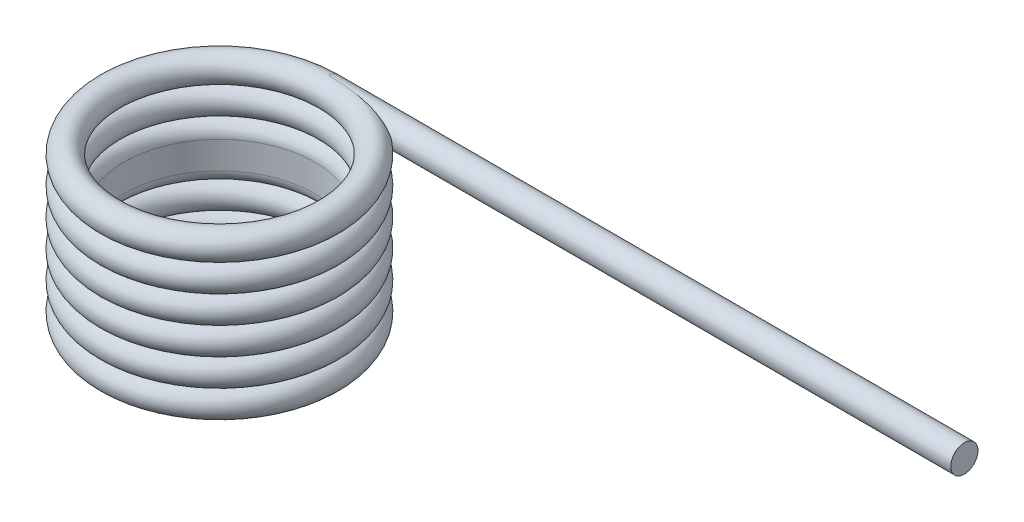
ISO-10303-21;
HEADER;
FILE_DESCRIPTION(('STEP AP214'),'2;1');
FILE_NAME('part.step','',(''),(''),'','','');
FILE_SCHEMA(('AUTOMOTIVE_DESIGN { 1 0 10303 214 1 1 1 1 }'));
ENDSEC;
DATA;
#1=APPLICATION_CONTEXT('core data for automotive mechanical design processes');
#2=APPLICATION_PROTOCOL_DEFINITION('international standard','automotive_design',2000,#1);
#3=PRODUCT_CONTEXT('',#1,'mechanical');
#4=PRODUCT('Part','Part','',(#3));
#5=PRODUCT_RELATED_PRODUCT_CATEGORY('part','',(#4));
#6=PRODUCT_DEFINITION_FORMATION('','',#4);
#7=PRODUCT_DEFINITION_CONTEXT('part definition',#1,'design');
#8=PRODUCT_DEFINITION('design','',#6,#7);
#9=PRODUCT_DEFINITION_SHAPE('','',#8);
#10=(LENGTH_UNIT() NAMED_UNIT(*) SI_UNIT(.MILLI.,.METRE.));
#11=(NAMED_UNIT(*) PLANE_ANGLE_UNIT() SI_UNIT($,.RADIAN.));
#12=(NAMED_UNIT(*) SI_UNIT($,.STERADIAN.) SOLID_ANGLE_UNIT());
#13=UNCERTAINTY_MEASURE_WITH_UNIT(LENGTH_MEASURE(1.E-05),#10,'distance_accuracy_value','');
#14=(GEOMETRIC_REPRESENTATION_CONTEXT(3) GLOBAL_UNCERTAINTY_ASSIGNED_CONTEXT((#13)) GLOBAL_UNIT_ASSIGNED_CONTEXT((#10,
#11,#12)) REPRESENTATION_CONTEXT('',''));
#15=CARTESIAN_POINT('',(0.,0.,0.));
#16=DIRECTION('',(0.,0.,1.));
#17=DIRECTION('',(1.,0.,0.));
#18=AXIS2_PLACEMENT_3D('',#15,#16,#17);
#19=CARTESIAN_POINT('',(0.,-2.5146,-2.0574));
#20=DIRECTION('',(0.,1.,0.));
#21=DIRECTION('',(0.,0.,1.));
#22=AXIS2_PLACEMENT_3D('',#19,#20,#21);
#23=TOROIDAL_SURFACE('',#22,1.8288,0.2286);
#24=CARTESIAN_POINT('',(0.,-2.5146,0.));
#25=VERTEX_POINT('',#24);
#26=VERTEX_LOOP('',#25);
#27=FACE_BOUND('',#26,.T.);
#28=ADVANCED_FACE('F40',(#27),#23,.T.);
#29=CLOSED_SHELL('',(#28));
#30=MANIFOLD_SOLID_BREP('B2',#29);
#31=CARTESIAN_POINT('',(0.,-2.0574,-2.0574));
#32=DIRECTION('',(0.,1.,0.));
#33=DIRECTION('',(0.,0.,1.));
#34=AXIS2_PLACEMENT_3D('',#31,#32,#33);
#35=TOROIDAL_SURFACE('',#34,1.8288,0.2286);
#36=CARTESIAN_POINT('',(0.,-2.0574,0.));
#37=VERTEX_POINT('',#36);
#38=VERTEX_LOOP('',#37);
#39=FACE_BOUND('',#38,.T.);
#40=ADVANCED_FACE('F61',(#39),#35,.T.);
#41=CLOSED_SHELL('',(#40));
#42=MANIFOLD_SOLID_BREP('B6',#41);
#43=CARTESIAN_POINT('',(0.,-1.6002,-2.0574));
#44=DIRECTION('',(0.,1.,0.));
#45=DIRECTION('',(0.,0.,1.));
#46=AXIS2_PLACEMENT_3D('',#43,#44,#45);
#47=TOROIDAL_SURFACE('',#46,1.8288,0.2286);
#48=CARTESIAN_POINT('',(0.,-1.3716,-2.0574));
#49=DIRECTION('',(0.,1.,0.));
#50=DIRECTION('',(0.,0.,1.));
#51=AXIS2_PLACEMENT_3D('',#48,#49,#50);
#52=CIRCLE('',#51,1.8288);
#53=CARTESIAN_POINT('',(0.,-1.3716,-0.2286));
#54=VERTEX_POINT('',#53);
#55=EDGE_CURVE('E90',#54,#54,#52,.T.);
#56=ORIENTED_EDGE('',*,*,#55,.F.);
#57=EDGE_LOOP('',(#56));
#58=FACE_BOUND('',#57,.T.);
#59=CARTESIAN_POINT('',(0.,-1.6002,-2.0574));
#60=DIRECTION('',(0.,1.,0.));
#61=DIRECTION('',(0.,0.,1.));
#62=AXIS2_PLACEMENT_3D('',#59,#60,#61);
#63=CIRCLE('',#62,1.6002);
#64=CARTESIAN_POINT('',(0.,-1.6002,-0.4572));
#65=VERTEX_POINT('',#64);
#66=EDGE_CURVE('E60',#65,#65,#63,.T.);
#67=ORIENTED_EDGE('',*,*,#66,.T.);
#68=EDGE_LOOP('',(#67));
#69=FACE_BOUND('',#68,.T.);
#70=ADVANCED_FACE('F80',(#58,#69),#47,.T.);
#71=CARTESIAN_POINT('',(0.,0.,-2.0574));
#72=DIRECTION('',(0.,1.,0.));
#73=DIRECTION('',(0.,0.,1.));
#74=AXIS2_PLACEMENT_3D('',#71,#72,#73);
#75=CYLINDRICAL_SURFACE('',#74,1.6002);
#76=ORIENTED_EDGE('',*,*,#66,.F.);
#77=EDGE_LOOP('',(#76));
#78=FACE_BOUND('',#77,.T.);
#79=CARTESIAN_POINT('',(0.,-1.143,-2.0574));
#80=DIRECTION('',(0.,1.,0.));
#81=DIRECTION('',(0.,0.,1.));
#82=AXIS2_PLACEMENT_3D('',#79,#80,#81);
#83=CIRCLE('',#82,1.6002);
#84=CARTESIAN_POINT('',(0.,-1.143,-0.4572));
#85=VERTEX_POINT('',#84);
#86=EDGE_CURVE('E86',#85,#85,#83,.T.);
#87=ORIENTED_EDGE('',*,*,#86,.T.);
#88=EDGE_LOOP('',(#87));
#89=FACE_BOUND('',#88,.T.);
#90=ADVANCED_FACE('F101',(#78,#89),#75,.F.);
#91=CARTESIAN_POINT('',(0.,-1.143,-2.0574));
#92=DIRECTION('',(0.,1.,0.));
#93=DIRECTION('',(0.,0.,1.));
#94=AXIS2_PLACEMENT_3D('',#91,#92,#93);
#95=TOROIDAL_SURFACE('',#94,1.8288,0.2286);
#96=ORIENTED_EDGE('',*,*,#55,.T.);
#97=EDGE_LOOP('',(#96));
#98=FACE_BOUND('',#97,.T.);
#99=ORIENTED_EDGE('',*,*,#86,.F.);
#100=EDGE_LOOP('',(#99));
#101=FACE_BOUND('',#100,.T.);
#102=ADVANCED_FACE('F97',(#98,#101),#95,.T.);
#103=CLOSED_SHELL('',(#70,#90,#102));
#104=MANIFOLD_SOLID_BREP('B36',#103);
#105=CARTESIAN_POINT('',(0.,-0.6858,-2.0574));
#106=DIRECTION('',(0.,1.,0.));
#107=DIRECTION('',(0.,0.,1.));
#108=AXIS2_PLACEMENT_3D('',#105,#106,#107);
#109=TOROIDAL_SURFACE('',#108,1.8288,0.2286);
#110=CARTESIAN_POINT('',(0.,-0.6858,0.));
#111=VERTEX_POINT('',#110);
#112=VERTEX_LOOP('',#111);
#113=FACE_BOUND('',#112,.T.);
#114=ADVANCED_FACE('F136',(#113),#109,.T.);
#115=CLOSED_SHELL('',(#114));
#116=MANIFOLD_SOLID_BREP('B55',#115);
#117=CARTESIAN_POINT('',(0.,-0.2286,-2.0574));
#118=DIRECTION('',(0.,1.,0.));
#119=DIRECTION('',(0.,0.,1.));
#120=AXIS2_PLACEMENT_3D('',#117,#118,#119);
#121=TOROIDAL_SURFACE('',#120,1.8288,0.2286);
#122=CARTESIAN_POINT('',(0.,0.,-3.8862));
#123=CARTESIAN_POINT('',(0.0201603539655038,-5.26308416414582E-07,-3.88620004662681));
#124=CARTESIAN_POINT('',(0.0403206556864603,9.49905087033513E-08,-3.8860333095834));
#125=CARTESIAN_POINT('',(0.0718909333701866,-9.1018347601024E-07,-3.88551128514275));
#126=CARTESIAN_POINT('',(0.0833028540103279,-1.67846473374149E-06,-3.88526917289954));
#127=CARTESIAN_POINT('',(0.101690475410552,-4.27409700475779E-06,-3.88479303093912));
#128=CARTESIAN_POINT('',(0.108667069958455,-5.57398465056791E-06,-3.88459240983244));
#129=CARTESIAN_POINT('',(0.14354891460143,-1.42553109352951E-05,-3.88348952722854));
#130=CARTESIAN_POINT('',(0.171445651617482,-2.81819927839706E-05,-3.8822880575502));
#131=CARTESIAN_POINT('',(0.221193700220691,-9.30384125976216E-05,-3.87957705230307));
#132=CARTESIAN_POINT('',(0.243051975183008,-0.000135345116221746,-3.87818974214723));
#133=CARTESIAN_POINT('',(0.308608057216535,-0.000333408199289869,-3.87344175478071));
#134=CARTESIAN_POINT('',(0.352265601629588,-0.000560335847673007,-3.86949580940788));
#135=CARTESIAN_POINT('',(0.439430794623077,-0.00145126904614431,-3.86006304070765));
#136=CARTESIAN_POINT('',(0.482938337652965,-0.00211553653740267,-3.85457529506135));
#137=CARTESIAN_POINT('',(0.599309997824671,-0.00491272422112075,-3.83782733179599));
#138=CARTESIAN_POINT('',(0.671975622103272,-0.00773798454896955,-3.82518181608943));
#139=CARTESIAN_POINT('',(0.78009869995684,-0.0154676111806729,-3.80318755681588));
#140=CARTESIAN_POINT('',(0.815990502568292,-0.0186256488489024,-3.79535268410383));
#141=CARTESIAN_POINT('',(0.887349902552253,-0.0266221619635755,-3.7787363650822));
#142=CARTESIAN_POINT('',(0.922817731231488,-0.031459673388023,-3.76995546378519));
#143=CARTESIAN_POINT('',(0.99323359362939,-0.0435566094096151,-3.75151136347391));
#144=CARTESIAN_POINT('',(1.02818023383687,-0.0508216151815348,-3.7418461688691));
#145=CARTESIAN_POINT('',(1.07975442555137,-0.06454183252864,-3.72686441013988));
#146=CARTESIAN_POINT('',(1.09682185988916,-0.0695922956093316,-3.72178439265966));
#147=CARTESIAN_POINT('',(1.13050548116117,-0.0809296238593905,-3.71152801702501));
#148=CARTESIAN_POINT('',(1.14712212560108,-0.0872151776932917,-3.70635176627665));
#149=CARTESIAN_POINT('',(1.17978533090523,-0.101528851004206,-3.69596277663219));
#150=CARTESIAN_POINT('',(1.19582492368515,-0.109573053908426,-3.6907501619455));
#151=CARTESIAN_POINT('',(1.22650999822263,-0.128126161651541,-3.68058722963676));
#152=CARTESIAN_POINT('',(1.24116429298595,-0.138617770819722,-3.67563535727454));
#153=CARTESIAN_POINT('',(1.25947281895488,-0.156039952085683,-3.66935801052982));
#154=CARTESIAN_POINT('',(1.26448215896343,-0.161372358109216,-3.66762859962529));
#155=CARTESIAN_POINT('',(1.27367206086098,-0.172783106491747,-3.66443984138108));
#156=CARTESIAN_POINT('',(1.27785500381281,-0.178859221612907,-3.66297971898463));
#157=CARTESIAN_POINT('',(1.2837159025817,-0.189511746498372,-3.66092645253788));
#158=CARTESIAN_POINT('',(1.28575718963371,-0.193862309877629,-3.66020909866083));
#159=CARTESIAN_POINT('',(1.28916542354839,-0.202853165714753,-3.65900941184711));
#160=CARTESIAN_POINT('',(1.29053303716225,-0.207493166562725,-3.65852684654025));
#161=CARTESIAN_POINT('',(1.29246652238552,-0.217005317477019,-3.65784415059423));
#162=CARTESIAN_POINT('',(1.29302525308172,-0.221879147428177,-3.65764653558987));
#163=CARTESIAN_POINT('',(1.29324681307436,-0.231649341331034,-3.65756820652933));
#164=CARTESIAN_POINT('',(1.29290992420025,-0.236545697710181,-3.65768739278359));
#165=CARTESIAN_POINT('',(1.29147107387947,-0.245642551998406,-3.65819568895117));
#166=CARTESIAN_POINT('',(1.29045876026016,-0.249859692677263,-3.65855316629538));
#167=CARTESIAN_POINT('',(1.28785280454759,-0.258085184438236,-3.65947166110391));
#168=CARTESIAN_POINT('',(1.28625882317887,-0.262093412102934,-3.66003279735748));
#169=CARTESIAN_POINT('',(1.28157372744896,-0.272021777778478,-3.66167801723131));
#170=CARTESIAN_POINT('',(1.27814343566431,-0.277761523348534,-3.66287921924458));
#171=CARTESIAN_POINT('',(1.27048671534529,-0.28861275408596,-3.66554688765255));
#172=CARTESIAN_POINT('',(1.26625798844987,-0.293722353329355,-3.66701411933887));
#173=CARTESIAN_POINT('',(1.25362394632249,-0.307287906749447,-3.67137228222859));
#174=CARTESIAN_POINT('',(1.24460786935186,-0.315106046238757,-3.67445454108954));
#175=CARTESIAN_POINT('',(1.22563992984659,-0.329368414409317,-3.68086019938867));
#176=CARTESIAN_POINT('',(1.21568538286167,-0.335808518242736,-3.68418428396064));
#177=CARTESIAN_POINT('',(1.1904884376248,-0.350393507252251,-3.69248826659119));
#178=CARTESIAN_POINT('',(1.17492804694099,-0.357951121352663,-3.6975235517008));
#179=CARTESIAN_POINT('',(1.1431412580482,-0.371531157125466,-3.70759699644572));
#180=CARTESIAN_POINT('',(1.12691347780457,-0.37755018544371,-3.71263513828719));
#181=CARTESIAN_POINT('',(1.0775027504275,-0.39394393327773,-3.72763575067259));
#182=CARTESIAN_POINT('',(1.04370842860951,-0.402597928999887,-3.73744586812679));
#183=CARTESIAN_POINT('',(0.976764778225945,-0.416782989169968,-3.75592481202114));
#184=CARTESIAN_POINT('',(0.943645143863624,-0.422426781997228,-3.76462383302032));
#185=CARTESIAN_POINT('',(0.876925431085278,-0.431898101056335,-3.78122889431614));
#186=CARTESIAN_POINT('',(0.843324975626772,-0.435724111220687,-3.78913426837698));
#187=CARTESIAN_POINT('',(0.742240069841311,-0.44526793997758,-3.81150734071563));
#188=CARTESIAN_POINT('',(0.674291843841314,-0.449082776835456,-3.82468206290067));
#189=CARTESIAN_POINT('',(0.565128758130479,-0.453137832178314,-3.84277071744996));
#190=CARTESIAN_POINT('',(0.524123615244158,-0.454198110763212,-3.84887841446305));
#191=CARTESIAN_POINT('',(0.441924747145232,-0.455730155602469,-3.85973321056813));
#192=CARTESIAN_POINT('',(0.400731045278735,-0.456201992835811,-3.86448047370519));
#193=CARTESIAN_POINT('',(0.308666174553218,-0.456903734532991,-3.87352856967861));
#194=CARTESIAN_POINT('',(0.257759078305316,-0.457052504528296,-3.87747255492601));
#195=CARTESIAN_POINT('',(0.176370540185582,-0.457168660645754,-3.88207426715614));
#196=CARTESIAN_POINT('',(0.145926211201144,-0.457184985510504,-3.88341582210405));
#197=CARTESIAN_POINT('',(0.0971430311299874,-0.457197395848075,-3.8849558881577));
#198=CARTESIAN_POINT('',(0.0788117094125621,-0.457198952468578,-3.88539684157934));
#199=CARTESIAN_POINT('',(0.0403206234975053,-0.457200003729682,-3.88603331710908));
#200=CARTESIAN_POINT('',(0.0201603804914492,-0.45719927783596,-3.88620005937853));
#201=CARTESIAN_POINT('',(0.,-0.4572,-3.8862));
#202=B_SPLINE_CURVE_WITH_KNOTS('',3,(#122,#123,#124,#125,#126,#127,#128,#129,#130,#131,#132,
#133,#134,#135,#136,#137,#138,#139,#140,#141,#142,#143,#144,#145,#146,#147,#148,#149,#150,#151,
#152,#153,#154,#155,#156,#157,#158,#159,#160,#161,#162,#163,#164,#165,#166,#167,#168,#169,#170,
#171,#172,#173,#174,#175,#176,#177,#178,#179,#180,#181,#182,#183,#184,#185,#186,#187,#188,#189,
#190,#191,#192,#193,#194,#195,#196,#197,#198,#199,#200,#201),.UNSPECIFIED.,.F.,.F.,(4,2,2,2,2,2,
2,2,2,2,2,2,2,2,2,2,2,2,2,2,2,2,2,2,2,2,2,2,2,2,2,2,2,2,2,2,2,2,2,4),(0.,0.0604801620392889,
0.0947231173824106,0.115661519427901,0.199420257815667,0.26512486469911,0.396598646835225,
0.528151245856108,0.749349282767671,0.859927529791874,0.970442409290339,1.08121314782632,
1.13671200362874,1.19215224983984,1.24812246923346,1.30370853168744,1.32620412988521,
1.34863393563737,1.36316128707124,1.37767423139356,1.39231453242692,1.40695022706302,
1.41995136026004,1.43296008891798,1.45322372777659,1.47354661191271,1.51031434375685,
1.54719063811452,1.60110619934451,1.65513966498459,1.76360788705415,1.86766323138624,
1.97180520829507,2.17952267211433,2.30391810122351,2.42829852405348,2.58142983127415,
2.67284267510045,2.72785056367759,2.78833072571686),.UNSPECIFIED.);
#203=CARTESIAN_POINT('',(0.,-0.4572,-3.8862));
#204=VERTEX_POINT('',#203);
#205=CARTESIAN_POINT('',(0.,0.,-3.8862));
#206=VERTEX_POINT('',#205);
#207=EDGE_CURVE('E156',#204,#206,#202,.F.);
#208=ORIENTED_EDGE('',*,*,#207,.T.);
#209=CARTESIAN_POINT('',(0.,-0.2286,-3.8862));
#210=DIRECTION('',(1.,0.,0.));
#211=DIRECTION('',(0.,0.,-1.));
#212=AXIS2_PLACEMENT_3D('',#209,#210,#211);
#213=CIRCLE('',#212,0.2286);
#214=EDGE_CURVE('E134',#204,#206,#213,.T.);
#215=ORIENTED_EDGE('',*,*,#214,.F.);
#216=EDGE_LOOP('',(#208,#215));
#217=FACE_BOUND('',#216,.T.);
#218=ADVANCED_FACE('F149',(#217),#121,.T.);
#219=CARTESIAN_POINT('',(10.668,-0.2286,-3.8862));
#220=DIRECTION('',(1.,0.,0.));
#221=DIRECTION('',(0.,0.,-1.));
#222=AXIS2_PLACEMENT_3D('',#219,#220,#221);
#223=PLANE('',#222);
#224=CARTESIAN_POINT('',(10.668,-0.2286,-3.8862));
#225=DIRECTION('',(1.,0.,0.));
#226=DIRECTION('',(0.,0.,-1.));
#227=AXIS2_PLACEMENT_3D('',#224,#225,#226);
#228=CIRCLE('',#227,0.2286);
#229=CARTESIAN_POINT('',(10.668,-0.2286,-4.1148));
#230=VERTEX_POINT('',#229);
#231=EDGE_CURVE('E164',#230,#230,#228,.T.);
#232=ORIENTED_EDGE('',*,*,#231,.T.);
#233=EDGE_LOOP('',(#232));
#234=FACE_BOUND('',#233,.T.);
#235=ADVANCED_FACE('F175',(#234),#223,.T.);
#236=CARTESIAN_POINT('',(-2.0584,-0.2286,-3.8862));
#237=DIRECTION('',(1.,0.,0.));
#238=DIRECTION('',(0.,0.,-1.));
#239=AXIS2_PLACEMENT_3D('',#236,#237,#238);
#240=CYLINDRICAL_SURFACE('',#239,0.2286);
#241=ORIENTED_EDGE('',*,*,#231,.F.);
#242=EDGE_LOOP('',(#241));
#243=FACE_BOUND('',#242,.T.);
#244=ORIENTED_EDGE('',*,*,#207,.F.);
#245=ORIENTED_EDGE('',*,*,#214,.T.);
#246=EDGE_LOOP('',(#244,#245));
#247=FACE_BOUND('',#246,.T.);
#248=ADVANCED_FACE('F163',(#243,#247),#240,.T.);
#249=CLOSED_SHELL('',(#218,#235,#248));
#250=MANIFOLD_SOLID_BREP('B76',#249);
#251=ADVANCED_BREP_SHAPE_REPRESENTATION('',(#18,#30,#42,#104,#116,#250),#14);
#252=SHAPE_DEFINITION_REPRESENTATION(#9,#251);
ENDSEC;
END-ISO-10303-21;
